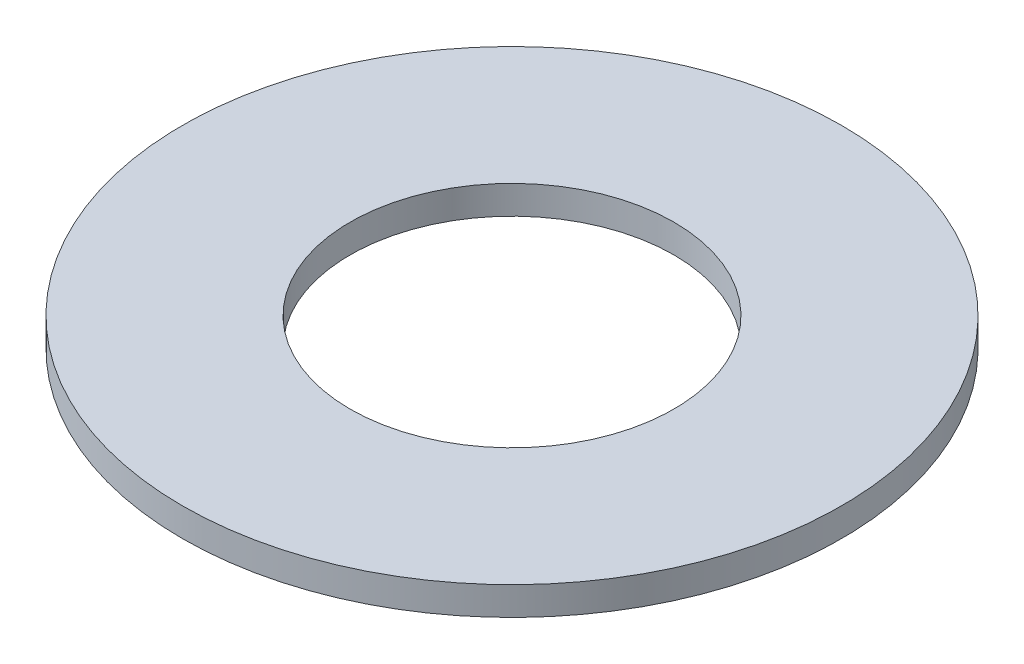
ISO-10303-21;
HEADER;
FILE_DESCRIPTION(('STEP AP214'),'2;1');
FILE_NAME('part.step','',(''),(''),'','','');
FILE_SCHEMA(('AUTOMOTIVE_DESIGN { 1 0 10303 214 1 1 1 1 }'));
ENDSEC;
DATA;
#1=APPLICATION_CONTEXT('core data for automotive mechanical design processes');
#2=APPLICATION_PROTOCOL_DEFINITION('international standard','automotive_design',2000,#1);
#3=PRODUCT_CONTEXT('',#1,'mechanical');
#4=PRODUCT('Part','Part','',(#3));
#5=PRODUCT_RELATED_PRODUCT_CATEGORY('part','',(#4));
#6=PRODUCT_DEFINITION_FORMATION('','',#4);
#7=PRODUCT_DEFINITION_CONTEXT('part definition',#1,'design');
#8=PRODUCT_DEFINITION('design','',#6,#7);
#9=PRODUCT_DEFINITION_SHAPE('','',#8);
#10=(LENGTH_UNIT() NAMED_UNIT(*) SI_UNIT(.MILLI.,.METRE.));
#11=(NAMED_UNIT(*) PLANE_ANGLE_UNIT() SI_UNIT($,.RADIAN.));
#12=(NAMED_UNIT(*) SI_UNIT($,.STERADIAN.) SOLID_ANGLE_UNIT());
#13=UNCERTAINTY_MEASURE_WITH_UNIT(LENGTH_MEASURE(1.E-05),#10,'distance_accuracy_value','');
#14=(GEOMETRIC_REPRESENTATION_CONTEXT(3) GLOBAL_UNCERTAINTY_ASSIGNED_CONTEXT((#13)) GLOBAL_UNIT_ASSIGNED_CONTEXT((#10,
#11,#12)) REPRESENTATION_CONTEXT('',''));
#15=CARTESIAN_POINT('',(0.,0.,0.));
#16=DIRECTION('',(0.,0.,1.));
#17=DIRECTION('',(1.,0.,0.));
#18=AXIS2_PLACEMENT_3D('',#15,#16,#17);
#19=CARTESIAN_POINT('',(0.,0.5,0.));
#20=DIRECTION('',(0.,1.,0.));
#21=DIRECTION('',(0.,0.,1.));
#22=AXIS2_PLACEMENT_3D('',#19,#20,#21);
#23=PLANE('',#22);
#24=CARTESIAN_POINT('',(0.,0.5,0.));
#25=DIRECTION('',(0.,1.,0.));
#26=DIRECTION('',(0.,0.,1.));
#27=AXIS2_PLACEMENT_3D('',#24,#25,#26);
#28=CIRCLE('',#27,5.8);
#29=CARTESIAN_POINT('',(0.,0.5,5.8));
#30=VERTEX_POINT('',#29);
#31=EDGE_CURVE('E10',#30,#30,#28,.T.);
#32=ORIENTED_EDGE('',*,*,#31,.T.);
#33=EDGE_LOOP('',(#32));
#34=FACE_BOUND('',#33,.T.);
#35=CARTESIAN_POINT('',(0.,0.5,0.));
#36=DIRECTION('',(0.,1.,0.));
#37=DIRECTION('',(0.,0.,1.));
#38=AXIS2_PLACEMENT_3D('',#35,#36,#37);
#39=CIRCLE('',#38,2.85);
#40=CARTESIAN_POINT('',(0.,0.5,2.85));
#41=VERTEX_POINT('',#40);
#42=EDGE_CURVE('E45',#41,#41,#39,.T.);
#43=ORIENTED_EDGE('',*,*,#42,.F.);
#44=EDGE_LOOP('',(#43));
#45=FACE_BOUND('',#44,.T.);
#46=ADVANCED_FACE('F34',(#34,#45),#23,.T.);
#47=CARTESIAN_POINT('',(0.,0.,0.));
#48=DIRECTION('',(0.,1.,0.));
#49=DIRECTION('',(0.,0.,1.));
#50=AXIS2_PLACEMENT_3D('',#47,#48,#49);
#51=PLANE('',#50);
#52=CARTESIAN_POINT('',(0.,0.,0.));
#53=DIRECTION('',(0.,1.,0.));
#54=DIRECTION('',(0.,0.,1.));
#55=AXIS2_PLACEMENT_3D('',#52,#53,#54);
#56=CIRCLE('',#55,5.8);
#57=CARTESIAN_POINT('',(0.,0.,5.8));
#58=VERTEX_POINT('',#57);
#59=EDGE_CURVE('E38',#58,#58,#56,.T.);
#60=ORIENTED_EDGE('',*,*,#59,.F.);
#61=EDGE_LOOP('',(#60));
#62=FACE_BOUND('',#61,.T.);
#63=CARTESIAN_POINT('',(0.,0.,0.));
#64=DIRECTION('',(0.,1.,0.));
#65=DIRECTION('',(0.,0.,1.));
#66=AXIS2_PLACEMENT_3D('',#63,#64,#65);
#67=CIRCLE('',#66,2.85);
#68=CARTESIAN_POINT('',(0.,0.,2.85));
#69=VERTEX_POINT('',#68);
#70=EDGE_CURVE('E47',#69,#69,#67,.T.);
#71=ORIENTED_EDGE('',*,*,#70,.T.);
#72=EDGE_LOOP('',(#71));
#73=FACE_BOUND('',#72,.T.);
#74=ADVANCED_FACE('F57',(#62,#73),#51,.F.);
#75=CARTESIAN_POINT('',(0.,0.5,0.));
#76=DIRECTION('',(0.,-1.,0.));
#77=DIRECTION('',(0.,0.,-1.));
#78=AXIS2_PLACEMENT_3D('',#75,#76,#77);
#79=CYLINDRICAL_SURFACE('',#78,5.8);
#80=ORIENTED_EDGE('',*,*,#31,.F.);
#81=EDGE_LOOP('',(#80));
#82=FACE_BOUND('',#81,.T.);
#83=ORIENTED_EDGE('',*,*,#59,.T.);
#84=EDGE_LOOP('',(#83));
#85=FACE_BOUND('',#84,.T.);
#86=ADVANCED_FACE('F36',(#82,#85),#79,.T.);
#87=CARTESIAN_POINT('',(0.,0.5,0.));
#88=DIRECTION('',(0.,-1.,0.));
#89=DIRECTION('',(0.,0.,-1.));
#90=AXIS2_PLACEMENT_3D('',#87,#88,#89);
#91=CYLINDRICAL_SURFACE('',#90,2.85);
#92=ORIENTED_EDGE('',*,*,#42,.T.);
#93=EDGE_LOOP('',(#92));
#94=FACE_BOUND('',#93,.T.);
#95=ORIENTED_EDGE('',*,*,#70,.F.);
#96=EDGE_LOOP('',(#95));
#97=FACE_BOUND('',#96,.T.);
#98=ADVANCED_FACE('F53',(#94,#97),#91,.F.);
#99=CLOSED_SHELL('',(#46,#74,#86,#98));
#100=MANIFOLD_SOLID_BREP('B2',#99);
#101=ADVANCED_BREP_SHAPE_REPRESENTATION('',(#18,#100),#14);
#102=SHAPE_DEFINITION_REPRESENTATION(#9,#101);
ENDSEC;
END-ISO-10303-21;
